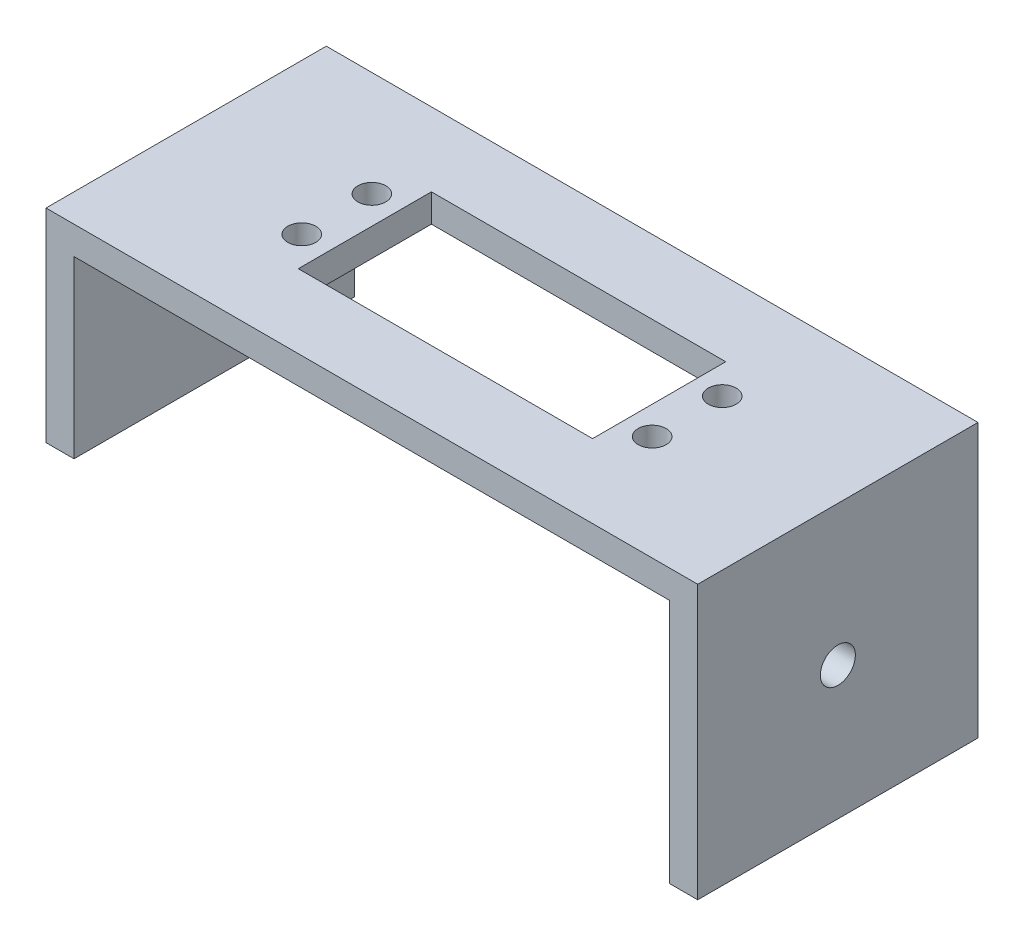
ISO-10303-21;
HEADER;
FILE_DESCRIPTION(('STEP AP214'),'2;1');
FILE_NAME('part.step','',(''),(''),'','','');
FILE_SCHEMA(('AUTOMOTIVE_DESIGN { 1 0 10303 214 1 1 1 1 }'));
ENDSEC;
DATA;
#1=APPLICATION_CONTEXT('core data for automotive mechanical design processes');
#2=APPLICATION_PROTOCOL_DEFINITION('international standard','automotive_design',2000,#1);
#3=PRODUCT_CONTEXT('',#1,'mechanical');
#4=PRODUCT('Part','Part','',(#3));
#5=PRODUCT_RELATED_PRODUCT_CATEGORY('part','',(#4));
#6=PRODUCT_DEFINITION_FORMATION('','',#4);
#7=PRODUCT_DEFINITION_CONTEXT('part definition',#1,'design');
#8=PRODUCT_DEFINITION('design','',#6,#7);
#9=PRODUCT_DEFINITION_SHAPE('','',#8);
#10=(LENGTH_UNIT() NAMED_UNIT(*) SI_UNIT(.MILLI.,.METRE.));
#11=(NAMED_UNIT(*) PLANE_ANGLE_UNIT() SI_UNIT($,.RADIAN.));
#12=(NAMED_UNIT(*) SI_UNIT($,.STERADIAN.) SOLID_ANGLE_UNIT());
#13=UNCERTAINTY_MEASURE_WITH_UNIT(LENGTH_MEASURE(1.E-05),#10,'distance_accuracy_value','');
#14=(GEOMETRIC_REPRESENTATION_CONTEXT(3) GLOBAL_UNCERTAINTY_ASSIGNED_CONTEXT((#13)) GLOBAL_UNIT_ASSIGNED_CONTEXT((#10,
#11,#12)) REPRESENTATION_CONTEXT('',''));
#15=CARTESIAN_POINT('',(0.,0.,0.));
#16=DIRECTION('',(0.,0.,1.));
#17=DIRECTION('',(1.,0.,0.));
#18=AXIS2_PLACEMENT_3D('',#15,#16,#17);
#19=CARTESIAN_POINT('',(-31.1459169574739,-11.0012437810945,40.));
#20=DIRECTION('',(-1.,0.,0.));
#21=DIRECTION('',(0.,0.,1.));
#22=AXIS2_PLACEMENT_3D('',#19,#20,#21);
#23=PLANE('',#22);
#24=CARTESIAN_POINT('',(-31.1459169574739,7.99875621890548,20.));
#25=DIRECTION('',(-1.,0.,0.));
#26=DIRECTION('',(0.,0.,1.));
#27=AXIS2_PLACEMENT_3D('',#24,#25,#26);
#28=CIRCLE('',#27,2.5);
#29=CARTESIAN_POINT('',(-31.1459169574739,7.99875621890548,22.5));
#30=VERTEX_POINT('',#29);
#31=EDGE_CURVE('E178',#30,#30,#28,.T.);
#32=ORIENTED_EDGE('',*,*,#31,.T.);
#33=EDGE_LOOP('',(#32));
#34=FACE_BOUND('',#33,.T.);
#35=DIRECTION('',(0.,1.,0.));
#36=VECTOR('',#35,1.);
#37=CARTESIAN_POINT('',(-31.1459169574739,-11.0012437810945,40.));
#38=LINE('',#37,#36);
#39=CARTESIAN_POINT('',(-31.1459169574739,-1.00124378109452,40.));
#40=VERTEX_POINT('',#39);
#41=CARTESIAN_POINT('',(-31.1459169574739,23.9987562189055,40.));
#42=VERTEX_POINT('',#41);
#43=EDGE_CURVE('E182',#40,#42,#38,.T.);
#44=ORIENTED_EDGE('',*,*,#43,.F.);
#45=DIRECTION('',(0.,0.,-1.));
#46=VECTOR('',#45,1.);
#47=CARTESIAN_POINT('',(-31.1459169574739,-1.00124378109452,40.));
#48=LINE('',#47,#46);
#49=CARTESIAN_POINT('',(-31.1459169574739,-1.00124378109452,0.));
#50=VERTEX_POINT('',#49);
#51=EDGE_CURVE('E166',#40,#50,#48,.T.);
#52=ORIENTED_EDGE('',*,*,#51,.T.);
#53=DIRECTION('',(0.,1.,0.));
#54=VECTOR('',#53,1.);
#55=CARTESIAN_POINT('',(-31.1459169574739,-11.0012437810945,0.));
#56=LINE('',#55,#54);
#57=CARTESIAN_POINT('',(-31.1459169574739,23.9987562189055,0.));
#58=VERTEX_POINT('',#57);
#59=EDGE_CURVE('E181',#50,#58,#56,.T.);
#60=ORIENTED_EDGE('',*,*,#59,.T.);
#61=DIRECTION('',(0.,0.,-1.));
#62=VECTOR('',#61,1.);
#63=CARTESIAN_POINT('',(-31.1459169574739,23.9987562189055,40.));
#64=LINE('',#63,#62);
#65=EDGE_CURVE('E45',#42,#58,#64,.T.);
#66=ORIENTED_EDGE('',*,*,#65,.F.);
#67=EDGE_LOOP('',(#44,#52,#60,#66));
#68=FACE_BOUND('',#67,.T.);
#69=ADVANCED_FACE('F38',(#34,#68),#23,.F.);
#70=CARTESIAN_POINT('',(-31.1459169574739,23.9987562189055,40.));
#71=DIRECTION('',(0.,1.,0.));
#72=DIRECTION('',(0.,0.,1.));
#73=AXIS2_PLACEMENT_3D('',#70,#71,#72);
#74=PLANE('',#73);
#75=CARTESIAN_POINT('',(-13.6459169574739,23.9987562189055,25.));
#76=DIRECTION('',(0.,1.,0.));
#77=DIRECTION('',(0.,0.,1.));
#78=AXIS2_PLACEMENT_3D('',#75,#76,#77);
#79=CIRCLE('',#78,2.);
#80=CARTESIAN_POINT('',(-13.6459169574739,23.9987562189055,27.));
#81=VERTEX_POINT('',#80);
#82=EDGE_CURVE('E415',#81,#81,#79,.T.);
#83=ORIENTED_EDGE('',*,*,#82,.T.);
#84=EDGE_LOOP('',(#83));
#85=FACE_BOUND('',#84,.T.);
#86=CARTESIAN_POINT('',(36.3540830425261,23.9987562189055,15.));
#87=DIRECTION('',(0.,1.,0.));
#88=DIRECTION('',(0.,0.,1.));
#89=AXIS2_PLACEMENT_3D('',#86,#87,#88);
#90=CIRCLE('',#89,2.);
#91=CARTESIAN_POINT('',(36.3540830425261,23.9987562189055,17.));
#92=VERTEX_POINT('',#91);
#93=EDGE_CURVE('E416',#92,#92,#90,.T.);
#94=ORIENTED_EDGE('',*,*,#93,.T.);
#95=EDGE_LOOP('',(#94));
#96=FACE_BOUND('',#95,.T.);
#97=CARTESIAN_POINT('',(36.3540830425261,23.9987562189055,25.));
#98=DIRECTION('',(0.,1.,0.));
#99=DIRECTION('',(0.,0.,1.));
#100=AXIS2_PLACEMENT_3D('',#97,#98,#99);
#101=CIRCLE('',#100,2.);
#102=CARTESIAN_POINT('',(36.3540830425261,23.9987562189055,27.));
#103=VERTEX_POINT('',#102);
#104=EDGE_CURVE('E419',#103,#103,#101,.T.);
#105=ORIENTED_EDGE('',*,*,#104,.T.);
#106=EDGE_LOOP('',(#105));
#107=FACE_BOUND('',#106,.T.);
#108=CARTESIAN_POINT('',(-13.6459169574739,23.9987562189055,15.));
#109=DIRECTION('',(0.,1.,0.));
#110=DIRECTION('',(0.,0.,1.));
#111=AXIS2_PLACEMENT_3D('',#108,#109,#110);
#112=CIRCLE('',#111,2.);
#113=CARTESIAN_POINT('',(-13.6459169574739,23.9987562189055,17.));
#114=VERTEX_POINT('',#113);
#115=EDGE_CURVE('E424',#114,#114,#112,.T.);
#116=ORIENTED_EDGE('',*,*,#115,.T.);
#117=EDGE_LOOP('',(#116));
#118=FACE_BOUND('',#117,.T.);
#119=DIRECTION('',(1.,0.,0.));
#120=VECTOR('',#119,1.);
#121=CARTESIAN_POINT('',(-31.1459169574739,23.9987562189055,29.5));
#122=LINE('',#121,#120);
#123=CARTESIAN_POINT('',(-9.64591695747391,23.9987562189055,29.5));
#124=VERTEX_POINT('',#123);
#125=CARTESIAN_POINT('',(32.3540830425261,23.9987562189055,29.5));
#126=VERTEX_POINT('',#125);
#127=EDGE_CURVE('E156',#124,#126,#122,.T.);
#128=ORIENTED_EDGE('',*,*,#127,.T.);
#129=DIRECTION('',(0.,0.,-1.));
#130=VECTOR('',#129,1.);
#131=CARTESIAN_POINT('',(32.3540830425261,23.9987562189055,40.));
#132=LINE('',#131,#130);
#133=CARTESIAN_POINT('',(32.3540830425261,23.9987562189055,10.5));
#134=VERTEX_POINT('',#133);
#135=EDGE_CURVE('E159',#126,#134,#132,.T.);
#136=ORIENTED_EDGE('',*,*,#135,.T.);
#137=DIRECTION('',(-1.,0.,0.));
#138=VECTOR('',#137,1.);
#139=CARTESIAN_POINT('',(-31.1459169574739,23.9987562189055,10.5));
#140=LINE('',#139,#138);
#141=CARTESIAN_POINT('',(-9.64591695747391,23.9987562189055,10.5));
#142=VERTEX_POINT('',#141);
#143=EDGE_CURVE('E151',#134,#142,#140,.T.);
#144=ORIENTED_EDGE('',*,*,#143,.T.);
#145=DIRECTION('',(0.,0.,1.));
#146=VECTOR('',#145,1.);
#147=CARTESIAN_POINT('',(-9.64591695747391,23.9987562189055,40.));
#148=LINE('',#147,#146);
#149=EDGE_CURVE('E131',#142,#124,#148,.T.);
#150=ORIENTED_EDGE('',*,*,#149,.T.);
#151=EDGE_LOOP('',(#128,#136,#144,#150));
#152=FACE_BOUND('',#151,.T.);
#153=DIRECTION('',(1.,0.,0.));
#154=VECTOR('',#153,1.);
#155=CARTESIAN_POINT('',(-31.1459169574739,23.9987562189055,0.));
#156=LINE('',#155,#154);
#157=CARTESIAN_POINT('',(53.8540830425261,23.9987562189055,0.));
#158=VERTEX_POINT('',#157);
#159=EDGE_CURVE('E200',#58,#158,#156,.T.);
#160=ORIENTED_EDGE('',*,*,#159,.T.);
#161=DIRECTION('',(0.,0.,-1.));
#162=VECTOR('',#161,1.);
#163=CARTESIAN_POINT('',(53.8540830425261,23.9987562189055,40.));
#164=LINE('',#163,#162);
#165=CARTESIAN_POINT('',(53.8540830425261,23.9987562189055,40.));
#166=VERTEX_POINT('',#165);
#167=EDGE_CURVE('E223',#166,#158,#164,.T.);
#168=ORIENTED_EDGE('',*,*,#167,.F.);
#169=DIRECTION('',(1.,0.,0.));
#170=VECTOR('',#169,1.);
#171=CARTESIAN_POINT('',(-31.1459169574739,23.9987562189055,40.));
#172=LINE('',#171,#170);
#173=EDGE_CURVE('E184',#42,#166,#172,.T.);
#174=ORIENTED_EDGE('',*,*,#173,.F.);
#175=ORIENTED_EDGE('',*,*,#65,.T.);
#176=EDGE_LOOP('',(#160,#168,#174,#175));
#177=FACE_BOUND('',#176,.T.);
#178=ADVANCED_FACE('F230',(#85,#96,#107,#118,#152,#177),#74,.F.);
#179=CARTESIAN_POINT('',(53.8540830425261,23.9987562189055,40.));
#180=DIRECTION('',(1.,0.,0.));
#181=DIRECTION('',(0.,0.,-1.));
#182=AXIS2_PLACEMENT_3D('',#179,#180,#181);
#183=PLANE('',#182);
#184=CARTESIAN_POINT('',(53.8540830425261,7.99875621890548,20.));
#185=DIRECTION('',(1.,0.,0.));
#186=DIRECTION('',(0.,0.,-1.));
#187=AXIS2_PLACEMENT_3D('',#184,#185,#186);
#188=CIRCLE('',#187,2.5);
#189=CARTESIAN_POINT('',(53.8540830425261,7.99875621890548,17.5));
#190=VERTEX_POINT('',#189);
#191=EDGE_CURVE('E173',#190,#190,#188,.T.);
#192=ORIENTED_EDGE('',*,*,#191,.T.);
#193=EDGE_LOOP('',(#192));
#194=FACE_BOUND('',#193,.T.);
#195=DIRECTION('',(0.,-1.,0.));
#196=VECTOR('',#195,1.);
#197=CARTESIAN_POINT('',(53.8540830425261,23.9987562189055,0.));
#198=LINE('',#197,#196);
#199=CARTESIAN_POINT('',(53.8540830425261,-11.0012437810945,0.));
#200=VERTEX_POINT('',#199);
#201=EDGE_CURVE('E202',#158,#200,#198,.T.);
#202=ORIENTED_EDGE('',*,*,#201,.T.);
#203=DIRECTION('',(0.,0.,-1.));
#204=VECTOR('',#203,1.);
#205=CARTESIAN_POINT('',(53.8540830425261,-11.0012437810945,40.));
#206=LINE('',#205,#204);
#207=CARTESIAN_POINT('',(53.8540830425261,-11.0012437810945,40.));
#208=VERTEX_POINT('',#207);
#209=EDGE_CURVE('E220',#208,#200,#206,.T.);
#210=ORIENTED_EDGE('',*,*,#209,.F.);
#211=DIRECTION('',(0.,-1.,0.));
#212=VECTOR('',#211,1.);
#213=CARTESIAN_POINT('',(53.8540830425261,23.9987562189055,40.));
#214=LINE('',#213,#212);
#215=EDGE_CURVE('E187',#166,#208,#214,.T.);
#216=ORIENTED_EDGE('',*,*,#215,.F.);
#217=ORIENTED_EDGE('',*,*,#167,.T.);
#218=EDGE_LOOP('',(#202,#210,#216,#217));
#219=FACE_BOUND('',#218,.T.);
#220=ADVANCED_FACE('F243',(#194,#219),#183,.F.);
#221=CARTESIAN_POINT('',(53.8540830425261,-11.0012437810945,40.));
#222=DIRECTION('',(0.,1.,0.));
#223=DIRECTION('',(0.,0.,1.));
#224=AXIS2_PLACEMENT_3D('',#221,#222,#223);
#225=PLANE('',#224);
#226=DIRECTION('',(1.,0.,0.));
#227=VECTOR('',#226,1.);
#228=CARTESIAN_POINT('',(53.8540830425261,-11.0012437810945,0.));
#229=LINE('',#228,#227);
#230=CARTESIAN_POINT('',(57.8540830425261,-11.0012437810945,0.));
#231=VERTEX_POINT('',#230);
#232=EDGE_CURVE('E204',#200,#231,#229,.T.);
#233=ORIENTED_EDGE('',*,*,#232,.T.);
#234=DIRECTION('',(0.,0.,-1.));
#235=VECTOR('',#234,1.);
#236=CARTESIAN_POINT('',(57.8540830425261,-11.0012437810945,40.));
#237=LINE('',#236,#235);
#238=CARTESIAN_POINT('',(57.8540830425261,-11.0012437810945,40.));
#239=VERTEX_POINT('',#238);
#240=EDGE_CURVE('E217',#239,#231,#237,.T.);
#241=ORIENTED_EDGE('',*,*,#240,.F.);
#242=DIRECTION('',(1.,0.,0.));
#243=VECTOR('',#242,1.);
#244=CARTESIAN_POINT('',(53.8540830425261,-11.0012437810945,40.));
#245=LINE('',#244,#243);
#246=EDGE_CURVE('E189',#208,#239,#245,.T.);
#247=ORIENTED_EDGE('',*,*,#246,.F.);
#248=ORIENTED_EDGE('',*,*,#209,.T.);
#249=EDGE_LOOP('',(#233,#241,#247,#248));
#250=FACE_BOUND('',#249,.T.);
#251=ADVANCED_FACE('F247',(#250),#225,.F.);
#252=CARTESIAN_POINT('',(57.8540830425261,-11.0012437810945,40.));
#253=DIRECTION('',(-1.,0.,0.));
#254=DIRECTION('',(0.,0.,1.));
#255=AXIS2_PLACEMENT_3D('',#252,#253,#254);
#256=PLANE('',#255);
#257=CARTESIAN_POINT('',(57.8540830425261,7.99875621890548,20.));
#258=DIRECTION('',(-1.,0.,0.));
#259=DIRECTION('',(0.,0.,1.));
#260=AXIS2_PLACEMENT_3D('',#257,#258,#259);
#261=CIRCLE('',#260,2.5);
#262=CARTESIAN_POINT('',(57.8540830425261,7.99875621890548,22.5));
#263=VERTEX_POINT('',#262);
#264=EDGE_CURVE('E170',#263,#263,#261,.T.);
#265=ORIENTED_EDGE('',*,*,#264,.T.);
#266=EDGE_LOOP('',(#265));
#267=FACE_BOUND('',#266,.T.);
#268=DIRECTION('',(0.,1.,0.));
#269=VECTOR('',#268,1.);
#270=CARTESIAN_POINT('',(57.8540830425261,-11.0012437810945,0.));
#271=LINE('',#270,#269);
#272=CARTESIAN_POINT('',(57.8540830425261,27.9987562189055,0.));
#273=VERTEX_POINT('',#272);
#274=EDGE_CURVE('E206',#231,#273,#271,.T.);
#275=ORIENTED_EDGE('',*,*,#274,.T.);
#276=DIRECTION('',(0.,0.,-1.));
#277=VECTOR('',#276,1.);
#278=CARTESIAN_POINT('',(57.8540830425261,27.9987562189055,40.));
#279=LINE('',#278,#277);
#280=CARTESIAN_POINT('',(57.8540830425261,27.9987562189055,40.));
#281=VERTEX_POINT('',#280);
#282=EDGE_CURVE('E214',#281,#273,#279,.T.);
#283=ORIENTED_EDGE('',*,*,#282,.F.);
#284=DIRECTION('',(0.,1.,0.));
#285=VECTOR('',#284,1.);
#286=CARTESIAN_POINT('',(57.8540830425261,-11.0012437810945,40.));
#287=LINE('',#286,#285);
#288=EDGE_CURVE('E191',#239,#281,#287,.T.);
#289=ORIENTED_EDGE('',*,*,#288,.F.);
#290=ORIENTED_EDGE('',*,*,#240,.T.);
#291=EDGE_LOOP('',(#275,#283,#289,#290));
#292=FACE_BOUND('',#291,.T.);
#293=ADVANCED_FACE('F265',(#267,#292),#256,.F.);
#294=CARTESIAN_POINT('',(57.8540830425261,27.9987562189055,40.));
#295=DIRECTION('',(0.,-1.,0.));
#296=DIRECTION('',(0.,0.,-1.));
#297=AXIS2_PLACEMENT_3D('',#294,#295,#296);
#298=PLANE('',#297);
#299=CARTESIAN_POINT('',(-13.6459169574739,27.9987562189055,25.));
#300=DIRECTION('',(0.,1.,0.));
#301=DIRECTION('',(0.,0.,1.));
#302=AXIS2_PLACEMENT_3D('',#299,#300,#301);
#303=CIRCLE('',#302,2.);
#304=CARTESIAN_POINT('',(-13.6459169574739,27.9987562189055,27.));
#305=VERTEX_POINT('',#304);
#306=EDGE_CURVE('E412',#305,#305,#303,.T.);
#307=ORIENTED_EDGE('',*,*,#306,.F.);
#308=EDGE_LOOP('',(#307));
#309=FACE_BOUND('',#308,.T.);
#310=CARTESIAN_POINT('',(36.3540830425261,27.9987562189055,15.));
#311=DIRECTION('',(0.,1.,0.));
#312=DIRECTION('',(0.,0.,1.));
#313=AXIS2_PLACEMENT_3D('',#310,#311,#312);
#314=CIRCLE('',#313,2.);
#315=CARTESIAN_POINT('',(36.3540830425261,27.9987562189055,17.));
#316=VERTEX_POINT('',#315);
#317=EDGE_CURVE('E430',#316,#316,#314,.T.);
#318=ORIENTED_EDGE('',*,*,#317,.F.);
#319=EDGE_LOOP('',(#318));
#320=FACE_BOUND('',#319,.T.);
#321=CARTESIAN_POINT('',(36.3540830425261,27.9987562189055,25.));
#322=DIRECTION('',(0.,1.,0.));
#323=DIRECTION('',(0.,0.,1.));
#324=AXIS2_PLACEMENT_3D('',#321,#322,#323);
#325=CIRCLE('',#324,2.);
#326=CARTESIAN_POINT('',(36.3540830425261,27.9987562189055,27.));
#327=VERTEX_POINT('',#326);
#328=EDGE_CURVE('E433',#327,#327,#325,.T.);
#329=ORIENTED_EDGE('',*,*,#328,.F.);
#330=EDGE_LOOP('',(#329));
#331=FACE_BOUND('',#330,.T.);
#332=CARTESIAN_POINT('',(-13.6459169574739,27.9987562189055,15.));
#333=DIRECTION('',(0.,1.,0.));
#334=DIRECTION('',(0.,0.,1.));
#335=AXIS2_PLACEMENT_3D('',#332,#333,#334);
#336=CIRCLE('',#335,2.);
#337=CARTESIAN_POINT('',(-13.6459169574739,27.9987562189055,17.));
#338=VERTEX_POINT('',#337);
#339=EDGE_CURVE('E427',#338,#338,#336,.T.);
#340=ORIENTED_EDGE('',*,*,#339,.F.);
#341=EDGE_LOOP('',(#340));
#342=FACE_BOUND('',#341,.T.);
#343=DIRECTION('',(-1.,0.,0.));
#344=VECTOR('',#343,1.);
#345=CARTESIAN_POINT('',(-9.64591695747391,27.9987562189055,10.5));
#346=LINE('',#345,#344);
#347=CARTESIAN_POINT('',(32.3540830425261,27.9987562189055,10.5));
#348=VERTEX_POINT('',#347);
#349=CARTESIAN_POINT('',(-9.64591695747391,27.9987562189055,10.5));
#350=VERTEX_POINT('',#349);
#351=EDGE_CURVE('E137',#348,#350,#346,.T.);
#352=ORIENTED_EDGE('',*,*,#351,.F.);
#353=DIRECTION('',(0.,0.,-1.));
#354=VECTOR('',#353,1.);
#355=CARTESIAN_POINT('',(32.3540830425261,27.9987562189055,10.5));
#356=LINE('',#355,#354);
#357=CARTESIAN_POINT('',(32.3540830425261,27.9987562189055,29.5));
#358=VERTEX_POINT('',#357);
#359=EDGE_CURVE('E60',#358,#348,#356,.T.);
#360=ORIENTED_EDGE('',*,*,#359,.F.);
#361=DIRECTION('',(1.,0.,0.));
#362=VECTOR('',#361,1.);
#363=CARTESIAN_POINT('',(-9.64591695747391,27.9987562189055,29.5));
#364=LINE('',#363,#362);
#365=CARTESIAN_POINT('',(-9.64591695747391,27.9987562189055,29.5));
#366=VERTEX_POINT('',#365);
#367=EDGE_CURVE('E144',#366,#358,#364,.T.);
#368=ORIENTED_EDGE('',*,*,#367,.F.);
#369=DIRECTION('',(0.,0.,1.));
#370=VECTOR('',#369,1.);
#371=CARTESIAN_POINT('',(-9.64591695747391,27.9987562189055,10.5));
#372=LINE('',#371,#370);
#373=EDGE_CURVE('E128',#350,#366,#372,.T.);
#374=ORIENTED_EDGE('',*,*,#373,.F.);
#375=EDGE_LOOP('',(#352,#360,#368,#374));
#376=FACE_BOUND('',#375,.T.);
#377=DIRECTION('',(-1.,0.,0.));
#378=VECTOR('',#377,1.);
#379=CARTESIAN_POINT('',(57.8540830425261,27.9987562189055,0.));
#380=LINE('',#379,#378);
#381=CARTESIAN_POINT('',(-35.1459169574739,27.9987562189055,0.));
#382=VERTEX_POINT('',#381);
#383=EDGE_CURVE('E208',#273,#382,#380,.T.);
#384=ORIENTED_EDGE('',*,*,#383,.T.);
#385=DIRECTION('',(0.,0.,-1.));
#386=VECTOR('',#385,1.);
#387=CARTESIAN_POINT('',(-35.1459169574739,27.9987562189055,40.));
#388=LINE('',#387,#386);
#389=CARTESIAN_POINT('',(-35.1459169574739,27.9987562189055,40.));
#390=VERTEX_POINT('',#389);
#391=EDGE_CURVE('E198',#390,#382,#388,.T.);
#392=ORIENTED_EDGE('',*,*,#391,.F.);
#393=DIRECTION('',(-1.,0.,0.));
#394=VECTOR('',#393,1.);
#395=CARTESIAN_POINT('',(57.8540830425261,27.9987562189055,40.));
#396=LINE('',#395,#394);
#397=EDGE_CURVE('E193',#281,#390,#396,.T.);
#398=ORIENTED_EDGE('',*,*,#397,.F.);
#399=ORIENTED_EDGE('',*,*,#282,.T.);
#400=EDGE_LOOP('',(#384,#392,#398,#399));
#401=FACE_BOUND('',#400,.T.);
#402=ADVANCED_FACE('F141',(#309,#320,#331,#342,#376,#401),#298,.F.);
#403=CARTESIAN_POINT('',(-35.1459169574739,-11.0012437810945,40.));
#404=DIRECTION('',(1.,0.,0.));
#405=DIRECTION('',(0.,0.,-1.));
#406=AXIS2_PLACEMENT_3D('',#403,#404,#405);
#407=PLANE('',#406);
#408=CARTESIAN_POINT('',(-35.1459169574739,7.99875621890548,20.));
#409=DIRECTION('',(-1.,0.,0.));
#410=DIRECTION('',(0.,0.,1.));
#411=AXIS2_PLACEMENT_3D('',#408,#409,#410);
#412=CIRCLE('',#411,2.5);
#413=CARTESIAN_POINT('',(-35.1459169574739,7.99875621890548,22.5));
#414=VERTEX_POINT('',#413);
#415=EDGE_CURVE('E169',#414,#414,#412,.T.);
#416=ORIENTED_EDGE('',*,*,#415,.F.);
#417=EDGE_LOOP('',(#416));
#418=FACE_BOUND('',#417,.T.);
#419=DIRECTION('',(0.,-1.,0.));
#420=VECTOR('',#419,1.);
#421=CARTESIAN_POINT('',(-35.1459169574739,-11.0012437810945,0.));
#422=LINE('',#421,#420);
#423=CARTESIAN_POINT('',(-35.1459169574739,-1.00124378109452,0.));
#424=VERTEX_POINT('',#423);
#425=EDGE_CURVE('E185',#382,#424,#422,.T.);
#426=ORIENTED_EDGE('',*,*,#425,.T.);
#427=DIRECTION('',(0.,0.,-1.));
#428=VECTOR('',#427,1.);
#429=CARTESIAN_POINT('',(-35.1459169574739,-1.00124378109452,40.));
#430=LINE('',#429,#428);
#431=CARTESIAN_POINT('',(-35.1459169574739,-1.00124378109452,40.));
#432=VERTEX_POINT('',#431);
#433=EDGE_CURVE('E162',#432,#424,#430,.T.);
#434=ORIENTED_EDGE('',*,*,#433,.F.);
#435=DIRECTION('',(0.,-1.,0.));
#436=VECTOR('',#435,1.);
#437=CARTESIAN_POINT('',(-35.1459169574739,-11.0012437810945,40.));
#438=LINE('',#437,#436);
#439=EDGE_CURVE('E195',#390,#432,#438,.T.);
#440=ORIENTED_EDGE('',*,*,#439,.F.);
#441=ORIENTED_EDGE('',*,*,#391,.T.);
#442=EDGE_LOOP('',(#426,#434,#440,#441));
#443=FACE_BOUND('',#442,.T.);
#444=ADVANCED_FACE('F260',(#418,#443),#407,.F.);
#445=CARTESIAN_POINT('',(0.,0.,40.));
#446=DIRECTION('',(0.,0.,-1.));
#447=DIRECTION('',(-1.,0.,0.));
#448=AXIS2_PLACEMENT_3D('',#445,#446,#447);
#449=PLANE('',#448);
#450=ORIENTED_EDGE('',*,*,#439,.T.);
#451=DIRECTION('',(-1.,0.,0.));
#452=VECTOR('',#451,1.);
#453=CARTESIAN_POINT('',(4.85408304252608,-1.00124378109452,40.));
#454=LINE('',#453,#452);
#455=EDGE_CURVE('E164',#40,#432,#454,.T.);
#456=ORIENTED_EDGE('',*,*,#455,.F.);
#457=ORIENTED_EDGE('',*,*,#43,.T.);
#458=ORIENTED_EDGE('',*,*,#173,.T.);
#459=ORIENTED_EDGE('',*,*,#215,.T.);
#460=ORIENTED_EDGE('',*,*,#246,.T.);
#461=ORIENTED_EDGE('',*,*,#288,.T.);
#462=ORIENTED_EDGE('',*,*,#397,.T.);
#463=EDGE_LOOP('',(#450,#456,#457,#458,#459,#460,#461,#462));
#464=FACE_BOUND('',#463,.T.);
#465=ADVANCED_FACE('F251',(#464),#449,.F.);
#466=CARTESIAN_POINT('',(0.,0.,0.));
#467=DIRECTION('',(0.,0.,-1.));
#468=DIRECTION('',(-1.,0.,0.));
#469=AXIS2_PLACEMENT_3D('',#466,#467,#468);
#470=PLANE('',#469);
#471=DIRECTION('',(1.,0.,0.));
#472=VECTOR('',#471,1.);
#473=CARTESIAN_POINT('',(0.,-1.00124378109452,0.));
#474=LINE('',#473,#472);
#475=EDGE_CURVE('E11',#424,#50,#474,.T.);
#476=ORIENTED_EDGE('',*,*,#475,.F.);
#477=ORIENTED_EDGE('',*,*,#425,.F.);
#478=ORIENTED_EDGE('',*,*,#383,.F.);
#479=ORIENTED_EDGE('',*,*,#274,.F.);
#480=ORIENTED_EDGE('',*,*,#232,.F.);
#481=ORIENTED_EDGE('',*,*,#201,.F.);
#482=ORIENTED_EDGE('',*,*,#159,.F.);
#483=ORIENTED_EDGE('',*,*,#59,.F.);
#484=EDGE_LOOP('',(#476,#477,#478,#479,#480,#481,#482,#483));
#485=FACE_BOUND('',#484,.T.);
#486=ADVANCED_FACE('F238',(#485),#470,.T.);
#487=CARTESIAN_POINT('',(57.8540830425261,7.99875621890548,20.));
#488=DIRECTION('',(-1.,0.,0.));
#489=DIRECTION('',(0.,0.,1.));
#490=AXIS2_PLACEMENT_3D('',#487,#488,#489);
#491=CYLINDRICAL_SURFACE('',#490,2.5);
#492=ORIENTED_EDGE('',*,*,#415,.T.);
#493=EDGE_LOOP('',(#492));
#494=FACE_BOUND('',#493,.T.);
#495=ORIENTED_EDGE('',*,*,#31,.F.);
#496=EDGE_LOOP('',(#495));
#497=FACE_BOUND('',#496,.T.);
#498=ADVANCED_FACE('F286',(#494,#497),#491,.F.);
#499=ORIENTED_EDGE('',*,*,#264,.F.);
#500=EDGE_LOOP('',(#499));
#501=FACE_BOUND('',#500,.T.);
#502=ORIENTED_EDGE('',*,*,#191,.F.);
#503=EDGE_LOOP('',(#502));
#504=FACE_BOUND('',#503,.T.);
#505=ADVANCED_FACE('F288',(#501,#504),#491,.F.);
#506=CARTESIAN_POINT('',(4.85408304252608,-1.00124378109452,40.));
#507=DIRECTION('',(0.,1.,0.));
#508=DIRECTION('',(0.,0.,1.));
#509=AXIS2_PLACEMENT_3D('',#506,#507,#508);
#510=PLANE('',#509);
#511=ORIENTED_EDGE('',*,*,#455,.T.);
#512=ORIENTED_EDGE('',*,*,#433,.T.);
#513=ORIENTED_EDGE('',*,*,#475,.T.);
#514=ORIENTED_EDGE('',*,*,#51,.F.);
#515=EDGE_LOOP('',(#511,#512,#513,#514));
#516=FACE_BOUND('',#515,.T.);
#517=ADVANCED_FACE('F255',(#516),#510,.F.);
#518=CARTESIAN_POINT('',(32.3540830425261,17.9987562189055,10.5));
#519=DIRECTION('',(1.,0.,0.));
#520=DIRECTION('',(0.,0.,-1.));
#521=AXIS2_PLACEMENT_3D('',#518,#519,#520);
#522=PLANE('',#521);
#523=DIRECTION('',(0.,1.,0.));
#524=VECTOR('',#523,1.);
#525=CARTESIAN_POINT('',(32.3540830425261,17.9987562189055,29.5));
#526=LINE('',#525,#524);
#527=EDGE_CURVE('E149',#126,#358,#526,.T.);
#528=ORIENTED_EDGE('',*,*,#527,.T.);
#529=ORIENTED_EDGE('',*,*,#359,.T.);
#530=DIRECTION('',(0.,1.,0.));
#531=VECTOR('',#530,1.);
#532=CARTESIAN_POINT('',(32.3540830425261,17.9987562189055,10.5));
#533=LINE('',#532,#531);
#534=EDGE_CURVE('E134',#134,#348,#533,.T.);
#535=ORIENTED_EDGE('',*,*,#534,.F.);
#536=ORIENTED_EDGE('',*,*,#135,.F.);
#537=EDGE_LOOP('',(#528,#529,#535,#536));
#538=FACE_BOUND('',#537,.T.);
#539=ADVANCED_FACE('F327',(#538),#522,.F.);
#540=CARTESIAN_POINT('',(-9.64591695747391,17.9987562189055,29.5));
#541=DIRECTION('',(0.,0.,1.));
#542=DIRECTION('',(1.,0.,0.));
#543=AXIS2_PLACEMENT_3D('',#540,#541,#542);
#544=PLANE('',#543);
#545=DIRECTION('',(0.,1.,0.));
#546=VECTOR('',#545,1.);
#547=CARTESIAN_POINT('',(-9.64591695747391,17.9987562189055,29.5));
#548=LINE('',#547,#546);
#549=EDGE_CURVE('E133',#124,#366,#548,.T.);
#550=ORIENTED_EDGE('',*,*,#549,.T.);
#551=ORIENTED_EDGE('',*,*,#367,.T.);
#552=ORIENTED_EDGE('',*,*,#527,.F.);
#553=ORIENTED_EDGE('',*,*,#127,.F.);
#554=EDGE_LOOP('',(#550,#551,#552,#553));
#555=FACE_BOUND('',#554,.T.);
#556=ADVANCED_FACE('F336',(#555),#544,.F.);
#557=CARTESIAN_POINT('',(-9.64591695747391,17.9987562189055,10.5));
#558=DIRECTION('',(-1.,0.,0.));
#559=DIRECTION('',(0.,0.,1.));
#560=AXIS2_PLACEMENT_3D('',#557,#558,#559);
#561=PLANE('',#560);
#562=DIRECTION('',(0.,1.,0.));
#563=VECTOR('',#562,1.);
#564=CARTESIAN_POINT('',(-9.64591695747391,17.9987562189055,10.5));
#565=LINE('',#564,#563);
#566=EDGE_CURVE('E52',#142,#350,#565,.T.);
#567=ORIENTED_EDGE('',*,*,#566,.T.);
#568=ORIENTED_EDGE('',*,*,#373,.T.);
#569=ORIENTED_EDGE('',*,*,#549,.F.);
#570=ORIENTED_EDGE('',*,*,#149,.F.);
#571=EDGE_LOOP('',(#567,#568,#569,#570));
#572=FACE_BOUND('',#571,.T.);
#573=ADVANCED_FACE('F125',(#572),#561,.F.);
#574=CARTESIAN_POINT('',(-9.64591695747391,17.9987562189055,10.5));
#575=DIRECTION('',(0.,0.,-1.));
#576=DIRECTION('',(-1.,0.,0.));
#577=AXIS2_PLACEMENT_3D('',#574,#575,#576);
#578=PLANE('',#577);
#579=ORIENTED_EDGE('',*,*,#534,.T.);
#580=ORIENTED_EDGE('',*,*,#351,.T.);
#581=ORIENTED_EDGE('',*,*,#566,.F.);
#582=ORIENTED_EDGE('',*,*,#143,.F.);
#583=EDGE_LOOP('',(#579,#580,#581,#582));
#584=FACE_BOUND('',#583,.T.);
#585=ADVANCED_FACE('F138',(#584),#578,.F.);
#586=CARTESIAN_POINT('',(-13.6459169574739,17.9987562189055,15.));
#587=DIRECTION('',(0.,1.,0.));
#588=DIRECTION('',(0.,0.,1.));
#589=AXIS2_PLACEMENT_3D('',#586,#587,#588);
#590=CYLINDRICAL_SURFACE('',#589,2.);
#591=ORIENTED_EDGE('',*,*,#339,.T.);
#592=EDGE_LOOP('',(#591));
#593=FACE_BOUND('',#592,.T.);
#594=ORIENTED_EDGE('',*,*,#115,.F.);
#595=EDGE_LOOP('',(#594));
#596=FACE_BOUND('',#595,.T.);
#597=ADVANCED_FACE('F360',(#593,#596),#590,.F.);
#598=CARTESIAN_POINT('',(36.3540830425261,17.9987562189055,25.));
#599=DIRECTION('',(0.,1.,0.));
#600=DIRECTION('',(0.,0.,1.));
#601=AXIS2_PLACEMENT_3D('',#598,#599,#600);
#602=CYLINDRICAL_SURFACE('',#601,2.);
#603=ORIENTED_EDGE('',*,*,#328,.T.);
#604=EDGE_LOOP('',(#603));
#605=FACE_BOUND('',#604,.T.);
#606=ORIENTED_EDGE('',*,*,#104,.F.);
#607=EDGE_LOOP('',(#606));
#608=FACE_BOUND('',#607,.T.);
#609=ADVANCED_FACE('F375',(#605,#608),#602,.F.);
#610=CARTESIAN_POINT('',(36.3540830425261,17.9987562189055,15.));
#611=DIRECTION('',(0.,1.,0.));
#612=DIRECTION('',(0.,0.,1.));
#613=AXIS2_PLACEMENT_3D('',#610,#611,#612);
#614=CYLINDRICAL_SURFACE('',#613,2.);
#615=ORIENTED_EDGE('',*,*,#317,.T.);
#616=EDGE_LOOP('',(#615));
#617=FACE_BOUND('',#616,.T.);
#618=ORIENTED_EDGE('',*,*,#93,.F.);
#619=EDGE_LOOP('',(#618));
#620=FACE_BOUND('',#619,.T.);
#621=ADVANCED_FACE('F385',(#617,#620),#614,.F.);
#622=CARTESIAN_POINT('',(-13.6459169574739,17.9987562189055,25.));
#623=DIRECTION('',(0.,1.,0.));
#624=DIRECTION('',(0.,0.,1.));
#625=AXIS2_PLACEMENT_3D('',#622,#623,#624);
#626=CYLINDRICAL_SURFACE('',#625,2.);
#627=ORIENTED_EDGE('',*,*,#306,.T.);
#628=EDGE_LOOP('',(#627));
#629=FACE_BOUND('',#628,.T.);
#630=ORIENTED_EDGE('',*,*,#82,.F.);
#631=EDGE_LOOP('',(#630));
#632=FACE_BOUND('',#631,.T.);
#633=ADVANCED_FACE('F395',(#629,#632),#626,.F.);
#634=CLOSED_SHELL('',(#69,#178,#220,#251,#293,#402,#444,#465,#486,#498,#505,#517,#539,#556,#573,
#585,#597,#609,#621,#633));
#635=MANIFOLD_SOLID_BREP('B2',#634);
#636=ADVANCED_BREP_SHAPE_REPRESENTATION('',(#18,#635),#14);
#637=SHAPE_DEFINITION_REPRESENTATION(#9,#636);
ENDSEC;
END-ISO-10303-21;
